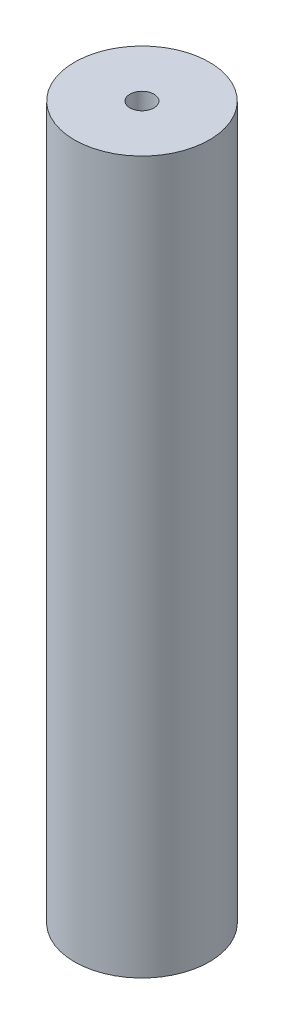
ISO-10303-21;
HEADER;
FILE_DESCRIPTION(('STEP AP214'),'2;1');
FILE_NAME('part.step','',(''),(''),'','','');
FILE_SCHEMA(('AUTOMOTIVE_DESIGN { 1 0 10303 214 1 1 1 1 }'));
ENDSEC;
DATA;
#1=APPLICATION_CONTEXT('core data for automotive mechanical design processes');
#2=APPLICATION_PROTOCOL_DEFINITION('international standard','automotive_design',2000,#1);
#3=PRODUCT_CONTEXT('',#1,'mechanical');
#4=PRODUCT('Part','Part','',(#3));
#5=PRODUCT_RELATED_PRODUCT_CATEGORY('part','',(#4));
#6=PRODUCT_DEFINITION_FORMATION('','',#4);
#7=PRODUCT_DEFINITION_CONTEXT('part definition',#1,'design');
#8=PRODUCT_DEFINITION('design','',#6,#7);
#9=PRODUCT_DEFINITION_SHAPE('','',#8);
#10=(LENGTH_UNIT() NAMED_UNIT(*) SI_UNIT(.MILLI.,.METRE.));
#11=(NAMED_UNIT(*) PLANE_ANGLE_UNIT() SI_UNIT($,.RADIAN.));
#12=(NAMED_UNIT(*) SI_UNIT($,.STERADIAN.) SOLID_ANGLE_UNIT());
#13=UNCERTAINTY_MEASURE_WITH_UNIT(LENGTH_MEASURE(1.E-05),#10,'distance_accuracy_value','');
#14=(GEOMETRIC_REPRESENTATION_CONTEXT(3) GLOBAL_UNCERTAINTY_ASSIGNED_CONTEXT((#13)) GLOBAL_UNIT_ASSIGNED_CONTEXT((#10,
#11,#12)) REPRESENTATION_CONTEXT('',''));
#15=CARTESIAN_POINT('',(0.,0.,0.));
#16=DIRECTION('',(0.,0.,1.));
#17=DIRECTION('',(1.,0.,0.));
#18=AXIS2_PLACEMENT_3D('',#15,#16,#17);
#19=CARTESIAN_POINT('',(0.,67.056,0.));
#20=DIRECTION('',(0.,1.,0.));
#21=DIRECTION('',(0.,0.,1.));
#22=AXIS2_PLACEMENT_3D('',#19,#20,#21);
#23=PLANE('',#22);
#24=CARTESIAN_POINT('',(0.,67.056,0.));
#25=DIRECTION('',(0.,1.,0.));
#26=DIRECTION('',(0.,0.,1.));
#27=AXIS2_PLACEMENT_3D('',#24,#25,#26);
#28=CIRCLE('',#27,6.35);
#29=CARTESIAN_POINT('',(0.,67.056,6.35));
#30=VERTEX_POINT('',#29);
#31=EDGE_CURVE('E10',#30,#30,#28,.T.);
#32=ORIENTED_EDGE('',*,*,#31,.T.);
#33=EDGE_LOOP('',(#32));
#34=FACE_BOUND('',#33,.T.);
#35=CARTESIAN_POINT('',(0.,67.056,0.));
#36=DIRECTION('',(0.,1.,0.));
#37=DIRECTION('',(0.,0.,1.));
#38=AXIS2_PLACEMENT_3D('',#35,#36,#37);
#39=CIRCLE('',#38,1.1303);
#40=CARTESIAN_POINT('',(0.,67.056,1.1303));
#41=VERTEX_POINT('',#40);
#42=EDGE_CURVE('E41',#41,#41,#39,.T.);
#43=ORIENTED_EDGE('',*,*,#42,.F.);
#44=EDGE_LOOP('',(#43));
#45=FACE_BOUND('',#44,.T.);
#46=ADVANCED_FACE('F30',(#34,#45),#23,.T.);
#47=CARTESIAN_POINT('',(0.,0.,0.));
#48=DIRECTION('',(0.,1.,0.));
#49=DIRECTION('',(0.,0.,1.));
#50=AXIS2_PLACEMENT_3D('',#47,#48,#49);
#51=PLANE('',#50);
#52=CARTESIAN_POINT('',(0.,0.,0.));
#53=DIRECTION('',(0.,1.,0.));
#54=DIRECTION('',(0.,0.,1.));
#55=AXIS2_PLACEMENT_3D('',#52,#53,#54);
#56=CIRCLE('',#55,6.35);
#57=CARTESIAN_POINT('',(0.,0.,6.35));
#58=VERTEX_POINT('',#57);
#59=EDGE_CURVE('E34',#58,#58,#56,.T.);
#60=ORIENTED_EDGE('',*,*,#59,.F.);
#61=EDGE_LOOP('',(#60));
#62=FACE_BOUND('',#61,.T.);
#63=CARTESIAN_POINT('',(0.,0.,0.));
#64=DIRECTION('',(0.,1.,0.));
#65=DIRECTION('',(0.,0.,1.));
#66=AXIS2_PLACEMENT_3D('',#63,#64,#65);
#67=CIRCLE('',#66,1.1303);
#68=CARTESIAN_POINT('',(0.,0.,1.1303));
#69=VERTEX_POINT('',#68);
#70=EDGE_CURVE('E43',#69,#69,#67,.T.);
#71=ORIENTED_EDGE('',*,*,#70,.T.);
#72=EDGE_LOOP('',(#71));
#73=FACE_BOUND('',#72,.T.);
#74=ADVANCED_FACE('F53',(#62,#73),#51,.F.);
#75=CARTESIAN_POINT('',(0.,67.056,0.));
#76=DIRECTION('',(0.,-1.,0.));
#77=DIRECTION('',(0.,0.,-1.));
#78=AXIS2_PLACEMENT_3D('',#75,#76,#77);
#79=CYLINDRICAL_SURFACE('',#78,6.35);
#80=ORIENTED_EDGE('',*,*,#31,.F.);
#81=EDGE_LOOP('',(#80));
#82=FACE_BOUND('',#81,.T.);
#83=ORIENTED_EDGE('',*,*,#59,.T.);
#84=EDGE_LOOP('',(#83));
#85=FACE_BOUND('',#84,.T.);
#86=ADVANCED_FACE('F32',(#82,#85),#79,.T.);
#87=CARTESIAN_POINT('',(0.,67.056,0.));
#88=DIRECTION('',(0.,-1.,0.));
#89=DIRECTION('',(0.,0.,-1.));
#90=AXIS2_PLACEMENT_3D('',#87,#88,#89);
#91=CYLINDRICAL_SURFACE('',#90,1.1303);
#92=ORIENTED_EDGE('',*,*,#42,.T.);
#93=EDGE_LOOP('',(#92));
#94=FACE_BOUND('',#93,.T.);
#95=ORIENTED_EDGE('',*,*,#70,.F.);
#96=EDGE_LOOP('',(#95));
#97=FACE_BOUND('',#96,.T.);
#98=ADVANCED_FACE('F49',(#94,#97),#91,.F.);
#99=CLOSED_SHELL('',(#46,#74,#86,#98));
#100=MANIFOLD_SOLID_BREP('B2',#99);
#101=ADVANCED_BREP_SHAPE_REPRESENTATION('',(#18,#100),#14);
#102=SHAPE_DEFINITION_REPRESENTATION(#9,#101);
ENDSEC;
END-ISO-10303-21;
